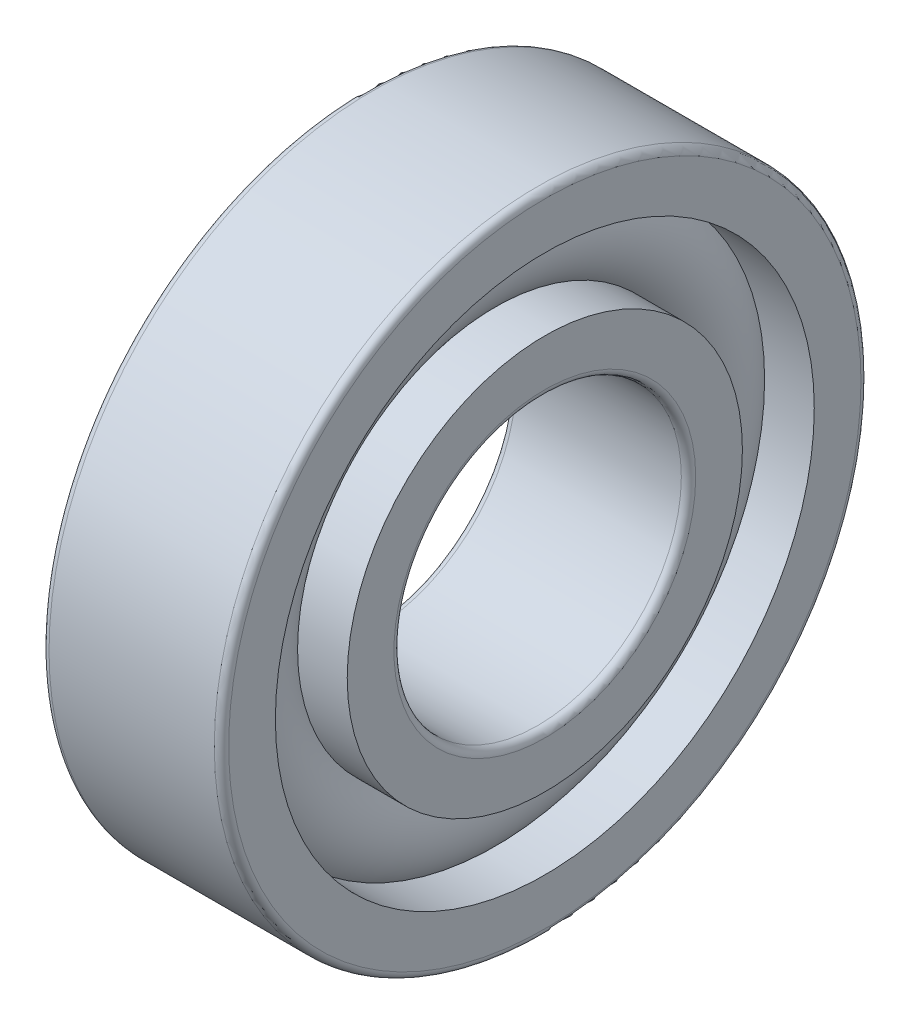
ISO-10303-21;
HEADER;
FILE_DESCRIPTION(('STEP AP214'),'2;1');
FILE_NAME('part.step','',(''),(''),'','','');
FILE_SCHEMA(('AUTOMOTIVE_DESIGN { 1 0 10303 214 1 1 1 1 }'));
ENDSEC;
DATA;
#1=APPLICATION_CONTEXT('core data for automotive mechanical design processes');
#2=APPLICATION_PROTOCOL_DEFINITION('international standard','automotive_design',2000,#1);
#3=PRODUCT_CONTEXT('',#1,'mechanical');
#4=PRODUCT('Part','Part','',(#3));
#5=PRODUCT_RELATED_PRODUCT_CATEGORY('part','',(#4));
#6=PRODUCT_DEFINITION_FORMATION('','',#4);
#7=PRODUCT_DEFINITION_CONTEXT('part definition',#1,'design');
#8=PRODUCT_DEFINITION('design','',#6,#7);
#9=PRODUCT_DEFINITION_SHAPE('','',#8);
#10=(LENGTH_UNIT() NAMED_UNIT(*) SI_UNIT(.MILLI.,.METRE.));
#11=(NAMED_UNIT(*) PLANE_ANGLE_UNIT() SI_UNIT($,.RADIAN.));
#12=(NAMED_UNIT(*) SI_UNIT($,.STERADIAN.) SOLID_ANGLE_UNIT());
#13=UNCERTAINTY_MEASURE_WITH_UNIT(LENGTH_MEASURE(1.E-05),#10,'distance_accuracy_value','');
#14=(GEOMETRIC_REPRESENTATION_CONTEXT(3) GLOBAL_UNCERTAINTY_ASSIGNED_CONTEXT((#13)) GLOBAL_UNIT_ASSIGNED_CONTEXT((#10,
#11,#12)) REPRESENTATION_CONTEXT('',''));
#15=CARTESIAN_POINT('',(0.,0.,0.));
#16=DIRECTION('',(0.,0.,1.));
#17=DIRECTION('',(1.,0.,0.));
#18=AXIS2_PLACEMENT_3D('',#15,#16,#17);
#19=CARTESIAN_POINT('',(0.,0.,0.));
#20=DIRECTION('',(-1.,0.,0.));
#21=DIRECTION('',(0.,0.,1.));
#22=AXIS2_PLACEMENT_3D('',#19,#20,#21);
#23=TOROIDAL_SURFACE('',#22,3.25,0.75);
#24=CARTESIAN_POINT('',(0.559016994374943,0.,0.));
#25=DIRECTION('',(-1.,0.,0.));
#26=DIRECTION('',(0.,0.,1.));
#27=AXIS2_PLACEMENT_3D('',#24,#25,#26);
#28=CIRCLE('',#27,3.75);
#29=CARTESIAN_POINT('',(0.559016994374943,0.,3.75));
#30=VERTEX_POINT('',#29);
#31=EDGE_CURVE('E35',#30,#30,#28,.F.);
#32=ORIENTED_EDGE('',*,*,#31,.T.);
#33=EDGE_LOOP('',(#32));
#34=FACE_BOUND('',#33,.T.);
#35=CARTESIAN_POINT('',(0.559016994374948,0.,0.));
#36=DIRECTION('',(-1.,0.,0.));
#37=DIRECTION('',(0.,0.,1.));
#38=AXIS2_PLACEMENT_3D('',#35,#36,#37);
#39=CIRCLE('',#38,2.75);
#40=CARTESIAN_POINT('',(0.559016994374948,0.,2.75));
#41=VERTEX_POINT('',#40);
#42=EDGE_CURVE('E10',#41,#41,#39,.T.);
#43=ORIENTED_EDGE('',*,*,#42,.T.);
#44=EDGE_LOOP('',(#43));
#45=FACE_BOUND('',#44,.T.);
#46=ADVANCED_FACE('F31',(#34,#45),#23,.T.);
#47=CARTESIAN_POINT('',(-20.6375,0.,0.));
#48=DIRECTION('',(1.,0.,0.));
#49=DIRECTION('',(0.,0.,-1.));
#50=AXIS2_PLACEMENT_3D('',#47,#48,#49);
#51=CYLINDRICAL_SURFACE('',#50,2.75);
#52=CARTESIAN_POINT('',(1.25,0.,0.));
#53=DIRECTION('',(1.,0.,0.));
#54=DIRECTION('',(0.,0.,-1.));
#55=AXIS2_PLACEMENT_3D('',#52,#53,#54);
#56=CIRCLE('',#55,2.75);
#57=CARTESIAN_POINT('',(1.25,0.,-2.75));
#58=VERTEX_POINT('',#57);
#59=EDGE_CURVE('E44',#58,#58,#56,.T.);
#60=ORIENTED_EDGE('',*,*,#59,.F.);
#61=EDGE_LOOP('',(#60));
#62=FACE_BOUND('',#61,.T.);
#63=ORIENTED_EDGE('',*,*,#42,.F.);
#64=EDGE_LOOP('',(#63));
#65=FACE_BOUND('',#64,.T.);
#66=ADVANCED_FACE('F83',(#62,#65),#51,.T.);
#67=CARTESIAN_POINT('',(-20.6375,0.,0.));
#68=DIRECTION('',(1.,0.,0.));
#69=DIRECTION('',(0.,0.,-1.));
#70=AXIS2_PLACEMENT_3D('',#67,#68,#69);
#71=CYLINDRICAL_SURFACE('',#70,2.75);
#72=CARTESIAN_POINT('',(-1.25,0.,0.));
#73=DIRECTION('',(1.,0.,0.));
#74=DIRECTION('',(0.,0.,-1.));
#75=AXIS2_PLACEMENT_3D('',#72,#73,#74);
#76=CIRCLE('',#75,2.75);
#77=CARTESIAN_POINT('',(-1.25,0.,-2.75));
#78=VERTEX_POINT('',#77);
#79=EDGE_CURVE('E53',#78,#78,#76,.T.);
#80=ORIENTED_EDGE('',*,*,#79,.T.);
#81=EDGE_LOOP('',(#80));
#82=FACE_BOUND('',#81,.T.);
#83=CARTESIAN_POINT('',(-0.559016994374948,0.,0.));
#84=DIRECTION('',(1.,0.,0.));
#85=DIRECTION('',(0.,0.,-1.));
#86=AXIS2_PLACEMENT_3D('',#83,#84,#85);
#87=CIRCLE('',#86,2.75);
#88=CARTESIAN_POINT('',(-0.559016994374948,0.,-2.75));
#89=VERTEX_POINT('',#88);
#90=EDGE_CURVE('E39',#89,#89,#87,.T.);
#91=ORIENTED_EDGE('',*,*,#90,.F.);
#92=EDGE_LOOP('',(#91));
#93=FACE_BOUND('',#92,.T.);
#94=ADVANCED_FACE('F86',(#82,#93),#71,.T.);
#95=CARTESIAN_POINT('',(1.25,2.1,0.));
#96=DIRECTION('',(1.,0.,0.));
#97=DIRECTION('',(0.,0.,-1.));
#98=AXIS2_PLACEMENT_3D('',#95,#96,#97);
#99=PLANE('',#98);
#100=ORIENTED_EDGE('',*,*,#59,.T.);
#101=EDGE_LOOP('',(#100));
#102=FACE_BOUND('',#101,.T.);
#103=CARTESIAN_POINT('',(1.25,0.,0.));
#104=DIRECTION('',(1.,0.,0.));
#105=DIRECTION('',(0.,0.,-1.));
#106=AXIS2_PLACEMENT_3D('',#103,#104,#105);
#107=CIRCLE('',#106,2.1);
#108=CARTESIAN_POINT('',(1.25,0.,-2.1));
#109=VERTEX_POINT('',#108);
#110=EDGE_CURVE('E75',#109,#109,#107,.T.);
#111=ORIENTED_EDGE('',*,*,#110,.F.);
#112=EDGE_LOOP('',(#111));
#113=FACE_BOUND('',#112,.T.);
#114=ADVANCED_FACE('F80',(#102,#113),#99,.T.);
#115=CARTESIAN_POINT('',(1.15,0.,0.));
#116=DIRECTION('',(1.,0.,0.));
#117=DIRECTION('',(0.,0.,-1.));
#118=AXIS2_PLACEMENT_3D('',#115,#116,#117);
#119=TOROIDAL_SURFACE('',#118,2.1,0.1);
#120=ORIENTED_EDGE('',*,*,#110,.T.);
#121=EDGE_LOOP('',(#120));
#122=FACE_BOUND('',#121,.T.);
#123=CARTESIAN_POINT('',(1.15,0.,0.));
#124=DIRECTION('',(1.,0.,0.));
#125=DIRECTION('',(0.,0.,-1.));
#126=AXIS2_PLACEMENT_3D('',#123,#124,#125);
#127=CIRCLE('',#126,2.);
#128=CARTESIAN_POINT('',(1.15,0.,-2.));
#129=VERTEX_POINT('',#128);
#130=EDGE_CURVE('E72',#129,#129,#127,.T.);
#131=ORIENTED_EDGE('',*,*,#130,.F.);
#132=EDGE_LOOP('',(#131));
#133=FACE_BOUND('',#132,.T.);
#134=ADVANCED_FACE('F97',(#122,#133),#119,.T.);
#135=CARTESIAN_POINT('',(-20.6375,0.,0.));
#136=DIRECTION('',(1.,0.,0.));
#137=DIRECTION('',(0.,0.,-1.));
#138=AXIS2_PLACEMENT_3D('',#135,#136,#137);
#139=CYLINDRICAL_SURFACE('',#138,2.);
#140=ORIENTED_EDGE('',*,*,#130,.T.);
#141=EDGE_LOOP('',(#140));
#142=FACE_BOUND('',#141,.T.);
#143=CARTESIAN_POINT('',(-1.15,0.,0.));
#144=DIRECTION('',(1.,0.,0.));
#145=DIRECTION('',(0.,0.,-1.));
#146=AXIS2_PLACEMENT_3D('',#143,#144,#145);
#147=CIRCLE('',#146,2.);
#148=CARTESIAN_POINT('',(-1.15,0.,-2.));
#149=VERTEX_POINT('',#148);
#150=EDGE_CURVE('E69',#149,#149,#147,.T.);
#151=ORIENTED_EDGE('',*,*,#150,.F.);
#152=EDGE_LOOP('',(#151));
#153=FACE_BOUND('',#152,.T.);
#154=ADVANCED_FACE('F100',(#142,#153),#139,.F.);
#155=CARTESIAN_POINT('',(-1.15,0.,0.));
#156=DIRECTION('',(1.,0.,0.));
#157=DIRECTION('',(0.,0.,-1.));
#158=AXIS2_PLACEMENT_3D('',#155,#156,#157);
#159=TOROIDAL_SURFACE('',#158,2.1,0.1);
#160=ORIENTED_EDGE('',*,*,#150,.T.);
#161=EDGE_LOOP('',(#160));
#162=FACE_BOUND('',#161,.T.);
#163=CARTESIAN_POINT('',(-1.25,0.,0.));
#164=DIRECTION('',(1.,0.,0.));
#165=DIRECTION('',(0.,0.,-1.));
#166=AXIS2_PLACEMENT_3D('',#163,#164,#165);
#167=CIRCLE('',#166,2.1);
#168=CARTESIAN_POINT('',(-1.25,0.,-2.1));
#169=VERTEX_POINT('',#168);
#170=EDGE_CURVE('E66',#169,#169,#167,.T.);
#171=ORIENTED_EDGE('',*,*,#170,.F.);
#172=EDGE_LOOP('',(#171));
#173=FACE_BOUND('',#172,.T.);
#174=ADVANCED_FACE('F104',(#162,#173),#159,.T.);
#175=CARTESIAN_POINT('',(-1.25,2.75,0.));
#176=DIRECTION('',(-1.,0.,0.));
#177=DIRECTION('',(0.,0.,1.));
#178=AXIS2_PLACEMENT_3D('',#175,#176,#177);
#179=PLANE('',#178);
#180=ORIENTED_EDGE('',*,*,#170,.T.);
#181=EDGE_LOOP('',(#180));
#182=FACE_BOUND('',#181,.T.);
#183=ORIENTED_EDGE('',*,*,#79,.F.);
#184=EDGE_LOOP('',(#183));
#185=FACE_BOUND('',#184,.T.);
#186=ADVANCED_FACE('F108',(#182,#185),#179,.T.);
#187=CARTESIAN_POINT('',(-0.559016994374943,0.,0.));
#188=DIRECTION('',(1.,0.,0.));
#189=DIRECTION('',(0.,0.,-1.));
#190=AXIS2_PLACEMENT_3D('',#187,#188,#189);
#191=CIRCLE('',#190,3.75);
#192=CARTESIAN_POINT('',(-0.559016994374943,0.,-3.75));
#193=VERTEX_POINT('',#192);
#194=EDGE_CURVE('E47',#193,#193,#191,.F.);
#195=ORIENTED_EDGE('',*,*,#194,.T.);
#196=EDGE_LOOP('',(#195));
#197=FACE_BOUND('',#196,.T.);
#198=ORIENTED_EDGE('',*,*,#90,.T.);
#199=EDGE_LOOP('',(#198));
#200=FACE_BOUND('',#199,.T.);
#201=ADVANCED_FACE('F33',(#197,#200),#23,.T.);
#202=CARTESIAN_POINT('',(-20.6375,0.,0.));
#203=DIRECTION('',(1.,0.,0.));
#204=DIRECTION('',(0.,0.,-1.));
#205=AXIS2_PLACEMENT_3D('',#202,#203,#204);
#206=CYLINDRICAL_SURFACE('',#205,3.75);
#207=CARTESIAN_POINT('',(1.25,0.,0.));
#208=DIRECTION('',(1.,0.,0.));
#209=DIRECTION('',(0.,0.,-1.));
#210=AXIS2_PLACEMENT_3D('',#207,#208,#209);
#211=CIRCLE('',#210,3.75);
#212=CARTESIAN_POINT('',(1.25,0.,-3.75));
#213=VERTEX_POINT('',#212);
#214=EDGE_CURVE('E49',#213,#213,#211,.T.);
#215=ORIENTED_EDGE('',*,*,#214,.T.);
#216=EDGE_LOOP('',(#215));
#217=FACE_BOUND('',#216,.T.);
#218=ORIENTED_EDGE('',*,*,#31,.F.);
#219=EDGE_LOOP('',(#218));
#220=FACE_BOUND('',#219,.T.);
#221=ADVANCED_FACE('F113',(#217,#220),#206,.F.);
#222=CARTESIAN_POINT('',(-20.6375,0.,0.));
#223=DIRECTION('',(1.,0.,0.));
#224=DIRECTION('',(0.,0.,-1.));
#225=AXIS2_PLACEMENT_3D('',#222,#223,#224);
#226=CYLINDRICAL_SURFACE('',#225,3.75);
#227=CARTESIAN_POINT('',(-1.25,0.,0.));
#228=DIRECTION('',(1.,0.,0.));
#229=DIRECTION('',(0.,0.,-1.));
#230=AXIS2_PLACEMENT_3D('',#227,#228,#229);
#231=CIRCLE('',#230,3.75);
#232=CARTESIAN_POINT('',(-1.25,0.,-3.75));
#233=VERTEX_POINT('',#232);
#234=EDGE_CURVE('E144',#233,#233,#231,.T.);
#235=ORIENTED_EDGE('',*,*,#234,.F.);
#236=EDGE_LOOP('',(#235));
#237=FACE_BOUND('',#236,.T.);
#238=ORIENTED_EDGE('',*,*,#194,.F.);
#239=EDGE_LOOP('',(#238));
#240=FACE_BOUND('',#239,.T.);
#241=ADVANCED_FACE('F116',(#237,#240),#226,.F.);
#242=CARTESIAN_POINT('',(1.25,4.4,0.));
#243=DIRECTION('',(1.,0.,0.));
#244=DIRECTION('',(0.,0.,-1.));
#245=AXIS2_PLACEMENT_3D('',#242,#243,#244);
#246=PLANE('',#245);
#247=CARTESIAN_POINT('',(1.25,0.,0.));
#248=DIRECTION('',(1.,0.,0.));
#249=DIRECTION('',(0.,0.,-1.));
#250=AXIS2_PLACEMENT_3D('',#247,#248,#249);
#251=CIRCLE('',#250,4.4);
#252=CARTESIAN_POINT('',(1.25,0.,-4.4));
#253=VERTEX_POINT('',#252);
#254=EDGE_CURVE('E55',#253,#253,#251,.T.);
#255=ORIENTED_EDGE('',*,*,#254,.T.);
#256=EDGE_LOOP('',(#255));
#257=FACE_BOUND('',#256,.T.);
#258=ORIENTED_EDGE('',*,*,#214,.F.);
#259=EDGE_LOOP('',(#258));
#260=FACE_BOUND('',#259,.T.);
#261=ADVANCED_FACE('F117',(#257,#260),#246,.T.);
#262=CARTESIAN_POINT('',(1.15,0.,0.));
#263=DIRECTION('',(1.,0.,0.));
#264=DIRECTION('',(0.,0.,-1.));
#265=AXIS2_PLACEMENT_3D('',#262,#263,#264);
#266=TOROIDAL_SURFACE('',#265,4.4,0.1);
#267=CARTESIAN_POINT('',(1.15,0.,0.));
#268=DIRECTION('',(1.,0.,0.));
#269=DIRECTION('',(0.,0.,-1.));
#270=AXIS2_PLACEMENT_3D('',#267,#268,#269);
#271=CIRCLE('',#270,4.5);
#272=CARTESIAN_POINT('',(1.15,0.,-4.5));
#273=VERTEX_POINT('',#272);
#274=EDGE_CURVE('E60',#273,#273,#271,.T.);
#275=ORIENTED_EDGE('',*,*,#274,.T.);
#276=EDGE_LOOP('',(#275));
#277=FACE_BOUND('',#276,.T.);
#278=ORIENTED_EDGE('',*,*,#254,.F.);
#279=EDGE_LOOP('',(#278));
#280=FACE_BOUND('',#279,.T.);
#281=ADVANCED_FACE('F120',(#277,#280),#266,.T.);
#282=CARTESIAN_POINT('',(-20.6375,0.,0.));
#283=DIRECTION('',(1.,0.,0.));
#284=DIRECTION('',(0.,0.,-1.));
#285=AXIS2_PLACEMENT_3D('',#282,#283,#284);
#286=CYLINDRICAL_SURFACE('',#285,4.5);
#287=CARTESIAN_POINT('',(-1.15,0.,0.));
#288=DIRECTION('',(1.,0.,0.));
#289=DIRECTION('',(0.,0.,-1.));
#290=AXIS2_PLACEMENT_3D('',#287,#288,#289);
#291=CIRCLE('',#290,4.5);
#292=CARTESIAN_POINT('',(-1.15,0.,-4.5));
#293=VERTEX_POINT('',#292);
#294=EDGE_CURVE('E148',#293,#293,#291,.T.);
#295=ORIENTED_EDGE('',*,*,#294,.T.);
#296=EDGE_LOOP('',(#295));
#297=FACE_BOUND('',#296,.T.);
#298=ORIENTED_EDGE('',*,*,#274,.F.);
#299=EDGE_LOOP('',(#298));
#300=FACE_BOUND('',#299,.T.);
#301=ADVANCED_FACE('F124',(#297,#300),#286,.T.);
#302=CARTESIAN_POINT('',(-1.15,0.,0.));
#303=DIRECTION('',(1.,0.,0.));
#304=DIRECTION('',(0.,0.,-1.));
#305=AXIS2_PLACEMENT_3D('',#302,#303,#304);
#306=TOROIDAL_SURFACE('',#305,4.4,0.1);
#307=CARTESIAN_POINT('',(-1.25,0.,0.));
#308=DIRECTION('',(1.,0.,0.));
#309=DIRECTION('',(0.,0.,-1.));
#310=AXIS2_PLACEMENT_3D('',#307,#308,#309);
#311=CIRCLE('',#310,4.4);
#312=CARTESIAN_POINT('',(-1.25,0.,-4.4));
#313=VERTEX_POINT('',#312);
#314=EDGE_CURVE('E145',#313,#313,#311,.T.);
#315=ORIENTED_EDGE('',*,*,#314,.T.);
#316=EDGE_LOOP('',(#315));
#317=FACE_BOUND('',#316,.T.);
#318=ORIENTED_EDGE('',*,*,#294,.F.);
#319=EDGE_LOOP('',(#318));
#320=FACE_BOUND('',#319,.T.);
#321=ADVANCED_FACE('F128',(#317,#320),#306,.T.);
#322=CARTESIAN_POINT('',(-1.25,3.75,0.));
#323=DIRECTION('',(-1.,0.,0.));
#324=DIRECTION('',(0.,0.,1.));
#325=AXIS2_PLACEMENT_3D('',#322,#323,#324);
#326=PLANE('',#325);
#327=ORIENTED_EDGE('',*,*,#234,.T.);
#328=EDGE_LOOP('',(#327));
#329=FACE_BOUND('',#328,.T.);
#330=ORIENTED_EDGE('',*,*,#314,.F.);
#331=EDGE_LOOP('',(#330));
#332=FACE_BOUND('',#331,.T.);
#333=ADVANCED_FACE('F132',(#329,#332),#326,.T.);
#334=CLOSED_SHELL('',(#46,#66,#94,#114,#134,#154,#174,#186,#201,#221,#241,#261,#281,#301,#321,#333));
#335=MANIFOLD_SOLID_BREP('B2',#334);
#336=ADVANCED_BREP_SHAPE_REPRESENTATION('',(#18,#335),#14);
#337=SHAPE_DEFINITION_REPRESENTATION(#9,#336);
ENDSEC;
END-ISO-10303-21;
